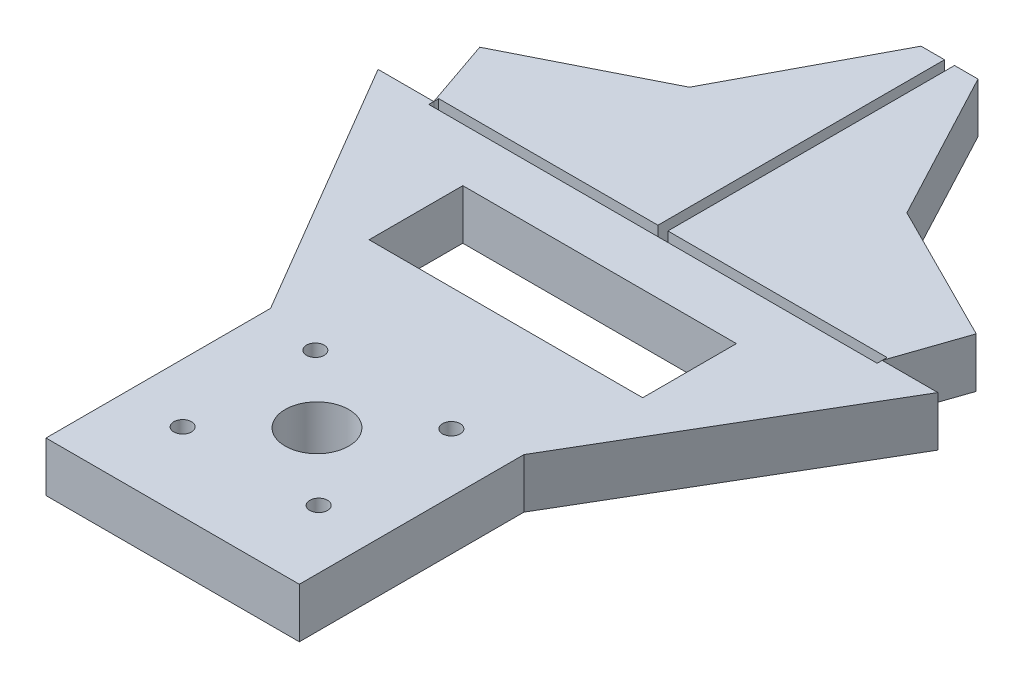
ISO-10303-21;
HEADER;
FILE_DESCRIPTION(('STEP AP214'),'2;1');
FILE_NAME('part.step','',(''),(''),'','','');
FILE_SCHEMA(('AUTOMOTIVE_DESIGN { 1 0 10303 214 1 1 1 1 }'));
ENDSEC;
DATA;
#1=APPLICATION_CONTEXT('core data for automotive mechanical design processes');
#2=APPLICATION_PROTOCOL_DEFINITION('international standard','automotive_design',2000,#1);
#3=PRODUCT_CONTEXT('',#1,'mechanical');
#4=PRODUCT('Part','Part','',(#3));
#5=PRODUCT_RELATED_PRODUCT_CATEGORY('part','',(#4));
#6=PRODUCT_DEFINITION_FORMATION('','',#4);
#7=PRODUCT_DEFINITION_CONTEXT('part definition',#1,'design');
#8=PRODUCT_DEFINITION('design','',#6,#7);
#9=PRODUCT_DEFINITION_SHAPE('','',#8);
#10=(LENGTH_UNIT() NAMED_UNIT(*) SI_UNIT(.MILLI.,.METRE.));
#11=(NAMED_UNIT(*) PLANE_ANGLE_UNIT() SI_UNIT($,.RADIAN.));
#12=(NAMED_UNIT(*) SI_UNIT($,.STERADIAN.) SOLID_ANGLE_UNIT());
#13=UNCERTAINTY_MEASURE_WITH_UNIT(LENGTH_MEASURE(1.E-05),#10,'distance_accuracy_value','');
#14=(GEOMETRIC_REPRESENTATION_CONTEXT(3) GLOBAL_UNCERTAINTY_ASSIGNED_CONTEXT((#13)) GLOBAL_UNIT_ASSIGNED_CONTEXT((#10,
#11,#12)) REPRESENTATION_CONTEXT('',''));
#15=CARTESIAN_POINT('',(0.,0.,0.));
#16=DIRECTION('',(0.,0.,1.));
#17=DIRECTION('',(1.,0.,0.));
#18=AXIS2_PLACEMENT_3D('',#15,#16,#17);
#19=CARTESIAN_POINT('',(0.,10.,0.));
#20=DIRECTION('',(0.,0.,1.));
#21=DIRECTION('',(1.,0.,0.));
#22=AXIS2_PLACEMENT_3D('',#19,#20,#21);
#23=PLANE('',#22);
#24=DIRECTION('',(-1.,0.,0.));
#25=VECTOR('',#24,1.);
#26=CARTESIAN_POINT('',(0.,0.,0.));
#27=LINE('',#26,#25);
#28=CARTESIAN_POINT('',(5.70896,0.,0.));
#29=VERTEX_POINT('',#28);
#30=CARTESIAN_POINT('',(1.,0.,0.));
#31=VERTEX_POINT('',#30);
#32=EDGE_CURVE('E98',#29,#31,#27,.T.);
#33=ORIENTED_EDGE('',*,*,#32,.T.);
#34=DIRECTION('',(0.,1.,0.));
#35=VECTOR('',#34,1.);
#36=CARTESIAN_POINT('',(1.,0.,0.));
#37=LINE('',#36,#35);
#38=CARTESIAN_POINT('',(1.,10.,0.));
#39=VERTEX_POINT('',#38);
#40=EDGE_CURVE('E86',#31,#39,#37,.T.);
#41=ORIENTED_EDGE('',*,*,#40,.T.);
#42=DIRECTION('',(-1.,0.,0.));
#43=VECTOR('',#42,1.);
#44=CARTESIAN_POINT('',(0.,10.,0.));
#45=LINE('',#44,#43);
#46=CARTESIAN_POINT('',(5.70896,10.,0.));
#47=VERTEX_POINT('',#46);
#48=EDGE_CURVE('E52',#47,#39,#45,.T.);
#49=ORIENTED_EDGE('',*,*,#48,.F.);
#50=DIRECTION('',(0.,-1.,0.));
#51=VECTOR('',#50,1.);
#52=CARTESIAN_POINT('',(5.70896,10.,0.));
#53=LINE('',#52,#51);
#54=EDGE_CURVE('E97',#47,#29,#53,.T.);
#55=ORIENTED_EDGE('',*,*,#54,.T.);
#56=EDGE_LOOP('',(#33,#41,#49,#55));
#57=FACE_BOUND('',#56,.T.);
#58=ADVANCED_FACE('F49',(#57),#23,.F.);
#59=CARTESIAN_POINT('',(0.,10.,0.));
#60=DIRECTION('',(0.,1.,0.));
#61=DIRECTION('',(0.,0.,1.));
#62=AXIS2_PLACEMENT_3D('',#59,#60,#61);
#63=PLANE('',#62);
#64=DIRECTION('',(0.,0.,-1.));
#65=VECTOR('',#64,1.);
#66=CARTESIAN_POINT('',(1.,10.,0.));
#67=LINE('',#66,#65);
#68=CARTESIAN_POINT('',(1.,10.,57.4708));
#69=VERTEX_POINT('',#68);
#70=EDGE_CURVE('E92',#69,#39,#67,.T.);
#71=ORIENTED_EDGE('',*,*,#70,.F.);
#72=DIRECTION('',(-1.,0.,0.));
#73=VECTOR('',#72,1.);
#74=CARTESIAN_POINT('',(1.,10.,57.4708));
#75=LINE('',#74,#73);
#76=CARTESIAN_POINT('',(44.9535276722083,10.,57.4708));
#77=VERTEX_POINT('',#76);
#78=EDGE_CURVE('E118',#77,#69,#75,.T.);
#79=ORIENTED_EDGE('',*,*,#78,.F.);
#80=DIRECTION('',(0.,0.,-1.));
#81=VECTOR('',#80,1.);
#82=CARTESIAN_POINT('',(44.9535276722083,10.,59.4708));
#83=LINE('',#82,#81);
#84=CARTESIAN_POINT('',(44.9535276722083,10.,58.4708));
#85=VERTEX_POINT('',#84);
#86=EDGE_CURVE('E12',#85,#77,#83,.T.);
#87=ORIENTED_EDGE('',*,*,#86,.F.);
#88=DIRECTION('',(-0.324824236659069,0.,0.945774399779807));
#89=VECTOR('',#88,1.);
#90=CARTESIAN_POINT('',(58.1732863228836,10.,19.9794933423652));
#91=LINE('',#90,#89);
#92=CARTESIAN_POINT('',(49.7781951130705,10.,44.4230583660901));
#93=VERTEX_POINT('',#92);
#94=EDGE_CURVE('E116',#93,#85,#91,.T.);
#95=ORIENTED_EDGE('',*,*,#94,.F.);
#96=DIRECTION('',(0.893364361129769,0.,0.449332970371862));
#97=VECTOR('',#96,1.);
#98=CARTESIAN_POINT('',(-7.78199451765094,10.,15.4721710156793));
#99=LINE('',#98,#97);
#100=CARTESIAN_POINT('',(21.8094583863086,10.,30.3557011960642));
#101=VERTEX_POINT('',#100);
#102=EDGE_CURVE('E115',#101,#93,#99,.T.);
#103=ORIENTED_EDGE('',*,*,#102,.F.);
#104=DIRECTION('',(0.468565731383776,0.,0.883428636264858));
#105=VECTOR('',#104,1.);
#106=CARTESIAN_POINT('',(4.45553588317703,10.,-2.36319193662813));
#107=LINE('',#106,#105);
#108=EDGE_CURVE('E132',#47,#101,#107,.T.);
#109=ORIENTED_EDGE('',*,*,#108,.F.);
#110=ORIENTED_EDGE('',*,*,#48,.T.);
#111=EDGE_LOOP('',(#71,#79,#87,#95,#103,#109,#110));
#112=FACE_BOUND('',#111,.T.);
#113=ADVANCED_FACE('F170',(#112),#63,.T.);
#114=CARTESIAN_POINT('',(0.,0.,0.));
#115=DIRECTION('',(0.,1.,0.));
#116=DIRECTION('',(0.,0.,1.));
#117=AXIS2_PLACEMENT_3D('',#114,#115,#116);
#118=PLANE('',#117);
#119=DIRECTION('',(-1.,0.,0.));
#120=VECTOR('',#119,1.);
#121=CARTESIAN_POINT('',(1.,0.,57.4708));
#122=LINE('',#121,#120);
#123=CARTESIAN_POINT('',(44.9535276722083,0.,57.4708));
#124=VERTEX_POINT('',#123);
#125=CARTESIAN_POINT('',(1.,0.,57.4708));
#126=VERTEX_POINT('',#125);
#127=EDGE_CURVE('E107',#124,#126,#122,.T.);
#128=ORIENTED_EDGE('',*,*,#127,.T.);
#129=DIRECTION('',(0.,0.,-1.));
#130=VECTOR('',#129,1.);
#131=CARTESIAN_POINT('',(1.,0.,0.));
#132=LINE('',#131,#130);
#133=EDGE_CURVE('E89',#126,#31,#132,.T.);
#134=ORIENTED_EDGE('',*,*,#133,.T.);
#135=ORIENTED_EDGE('',*,*,#32,.F.);
#136=DIRECTION('',(0.468565731383776,0.,0.883428636264858));
#137=VECTOR('',#136,1.);
#138=CARTESIAN_POINT('',(4.45553588317703,0.,-2.36319193662813));
#139=LINE('',#138,#137);
#140=CARTESIAN_POINT('',(21.8094583863086,0.,30.3557011960642));
#141=VERTEX_POINT('',#140);
#142=EDGE_CURVE('E108',#29,#141,#139,.T.);
#143=ORIENTED_EDGE('',*,*,#142,.T.);
#144=DIRECTION('',(0.893364361129769,0.,0.449332970371862));
#145=VECTOR('',#144,1.);
#146=CARTESIAN_POINT('',(-7.78199451765094,0.,15.4721710156793));
#147=LINE('',#146,#145);
#148=CARTESIAN_POINT('',(49.7781951130705,0.,44.4230583660901));
#149=VERTEX_POINT('',#148);
#150=EDGE_CURVE('E138',#141,#149,#147,.T.);
#151=ORIENTED_EDGE('',*,*,#150,.T.);
#152=DIRECTION('',(-0.324824236659069,0.,0.945774399779807));
#153=VECTOR('',#152,1.);
#154=CARTESIAN_POINT('',(58.1732863228836,0.,19.9794933423652));
#155=LINE('',#154,#153);
#156=CARTESIAN_POINT('',(44.9535276722083,0.,58.4708));
#157=VERTEX_POINT('',#156);
#158=EDGE_CURVE('E135',#149,#157,#155,.T.);
#159=ORIENTED_EDGE('',*,*,#158,.T.);
#160=DIRECTION('',(0.,0.,-1.));
#161=VECTOR('',#160,1.);
#162=CARTESIAN_POINT('',(44.9535276722083,0.,0.));
#163=LINE('',#162,#161);
#164=EDGE_CURVE('E67',#157,#124,#163,.T.);
#165=ORIENTED_EDGE('',*,*,#164,.T.);
#166=EDGE_LOOP('',(#128,#134,#135,#143,#151,#159,#165));
#167=FACE_BOUND('',#166,.T.);
#168=ADVANCED_FACE('F102',(#167),#118,.F.);
#169=CARTESIAN_POINT('',(58.1732863228836,10.,19.9794933423652));
#170=DIRECTION('',(0.945774399779807,0.,0.324824236659069));
#171=DIRECTION('',(0.324824236659069,0.,-0.945774399779807));
#172=AXIS2_PLACEMENT_3D('',#169,#170,#171);
#173=PLANE('',#172);
#174=ORIENTED_EDGE('',*,*,#158,.F.);
#175=DIRECTION('',(0.,-1.,0.));
#176=VECTOR('',#175,1.);
#177=CARTESIAN_POINT('',(49.7781951130705,10.,44.4230583660901));
#178=LINE('',#177,#176);
#179=EDGE_CURVE('E131',#93,#149,#178,.T.);
#180=ORIENTED_EDGE('',*,*,#179,.F.);
#181=ORIENTED_EDGE('',*,*,#94,.T.);
#182=DIRECTION('',(0.,-1.,0.));
#183=VECTOR('',#182,1.);
#184=CARTESIAN_POINT('',(44.9535276722083,10.,58.4708));
#185=LINE('',#184,#183);
#186=EDGE_CURVE('E113',#85,#157,#185,.T.);
#187=ORIENTED_EDGE('',*,*,#186,.T.);
#188=EDGE_LOOP('',(#174,#180,#181,#187));
#189=FACE_BOUND('',#188,.T.);
#190=ADVANCED_FACE('F167',(#189),#173,.T.);
#191=CARTESIAN_POINT('',(-7.78199451765094,10.,15.4721710156793));
#192=DIRECTION('',(0.449332970371862,0.,-0.893364361129769));
#193=DIRECTION('',(-0.893364361129769,0.,-0.449332970371862));
#194=AXIS2_PLACEMENT_3D('',#191,#192,#193);
#195=PLANE('',#194);
#196=ORIENTED_EDGE('',*,*,#150,.F.);
#197=DIRECTION('',(0.,-1.,0.));
#198=VECTOR('',#197,1.);
#199=CARTESIAN_POINT('',(21.8094583863086,10.,30.3557011960642));
#200=LINE('',#199,#198);
#201=EDGE_CURVE('E122',#101,#141,#200,.T.);
#202=ORIENTED_EDGE('',*,*,#201,.F.);
#203=ORIENTED_EDGE('',*,*,#102,.T.);
#204=ORIENTED_EDGE('',*,*,#179,.T.);
#205=EDGE_LOOP('',(#196,#202,#203,#204));
#206=FACE_BOUND('',#205,.T.);
#207=ADVANCED_FACE('F173',(#206),#195,.T.);
#208=CARTESIAN_POINT('',(4.45553588317703,10.,-2.36319193662813));
#209=DIRECTION('',(0.883428636264858,0.,-0.468565731383776));
#210=DIRECTION('',(-0.468565731383776,0.,-0.883428636264858));
#211=AXIS2_PLACEMENT_3D('',#208,#209,#210);
#212=PLANE('',#211);
#213=ORIENTED_EDGE('',*,*,#142,.F.);
#214=ORIENTED_EDGE('',*,*,#54,.F.);
#215=ORIENTED_EDGE('',*,*,#108,.T.);
#216=ORIENTED_EDGE('',*,*,#201,.T.);
#217=EDGE_LOOP('',(#213,#214,#215,#216));
#218=FACE_BOUND('',#217,.T.);
#219=ADVANCED_FACE('F175',(#218),#212,.T.);
#220=CARTESIAN_POINT('',(1.,0.,0.));
#221=DIRECTION('',(1.,0.,0.));
#222=DIRECTION('',(0.,0.,-1.));
#223=AXIS2_PLACEMENT_3D('',#220,#221,#222);
#224=PLANE('',#223);
#225=ORIENTED_EDGE('',*,*,#70,.T.);
#226=ORIENTED_EDGE('',*,*,#40,.F.);
#227=ORIENTED_EDGE('',*,*,#133,.F.);
#228=DIRECTION('',(0.,1.,0.));
#229=VECTOR('',#228,1.);
#230=CARTESIAN_POINT('',(1.,0.,57.4708));
#231=LINE('',#230,#229);
#232=EDGE_CURVE('E121',#126,#69,#231,.T.);
#233=ORIENTED_EDGE('',*,*,#232,.T.);
#234=EDGE_LOOP('',(#225,#226,#227,#233));
#235=FACE_BOUND('',#234,.T.);
#236=ADVANCED_FACE('F88',(#235),#224,.F.);
#237=CARTESIAN_POINT('',(1.,0.,57.4708));
#238=DIRECTION('',(0.,0.,-1.));
#239=DIRECTION('',(-1.,0.,0.));
#240=AXIS2_PLACEMENT_3D('',#237,#238,#239);
#241=PLANE('',#240);
#242=ORIENTED_EDGE('',*,*,#78,.T.);
#243=ORIENTED_EDGE('',*,*,#232,.F.);
#244=ORIENTED_EDGE('',*,*,#127,.F.);
#245=DIRECTION('',(0.,1.,0.));
#246=VECTOR('',#245,1.);
#247=CARTESIAN_POINT('',(44.9535276722083,0.,57.4708));
#248=LINE('',#247,#246);
#249=EDGE_CURVE('E58',#124,#77,#248,.T.);
#250=ORIENTED_EDGE('',*,*,#249,.T.);
#251=EDGE_LOOP('',(#242,#243,#244,#250));
#252=FACE_BOUND('',#251,.T.);
#253=ADVANCED_FACE('F196',(#252),#241,.F.);
#254=CARTESIAN_POINT('',(44.9535276722083,0.,59.4708));
#255=DIRECTION('',(1.,0.,0.));
#256=DIRECTION('',(0.,0.,-1.));
#257=AXIS2_PLACEMENT_3D('',#254,#255,#256);
#258=PLANE('',#257);
#259=ORIENTED_EDGE('',*,*,#186,.F.);
#260=ORIENTED_EDGE('',*,*,#86,.T.);
#261=ORIENTED_EDGE('',*,*,#249,.F.);
#262=ORIENTED_EDGE('',*,*,#164,.F.);
#263=EDGE_LOOP('',(#259,#260,#261,#262));
#264=FACE_BOUND('',#263,.T.);
#265=ADVANCED_FACE('F193',(#264),#258,.F.);
#266=CLOSED_SHELL('',(#58,#113,#168,#190,#207,#219,#236,#253,#265));
#267=MANIFOLD_SOLID_BREP('B2',#266);
#268=CARTESIAN_POINT('',(-4.45553588317703,10.,-2.36319193662813));
#269=DIRECTION('',(0.883428636264858,0.,0.468565731383776));
#270=DIRECTION('',(0.468565731383776,0.,-0.883428636264858));
#271=AXIS2_PLACEMENT_3D('',#268,#269,#270);
#272=PLANE('',#271);
#273=DIRECTION('',(-0.468565731383776,0.,0.883428636264858));
#274=VECTOR('',#273,1.);
#275=CARTESIAN_POINT('',(-4.45553588317703,0.,-2.36319193662813));
#276=LINE('',#275,#274);
#277=CARTESIAN_POINT('',(-5.70896,0.,0.));
#278=VERTEX_POINT('',#277);
#279=CARTESIAN_POINT('',(-21.8094583863086,0.,30.3557011960642));
#280=VERTEX_POINT('',#279);
#281=EDGE_CURVE('E382',#278,#280,#276,.T.);
#282=ORIENTED_EDGE('',*,*,#281,.T.);
#283=DIRECTION('',(0.,-1.,0.));
#284=VECTOR('',#283,1.);
#285=CARTESIAN_POINT('',(-21.8094583863086,10.,30.3557011960642));
#286=LINE('',#285,#284);
#287=CARTESIAN_POINT('',(-21.8094583863086,10.,30.3557011960642));
#288=VERTEX_POINT('',#287);
#289=EDGE_CURVE('E376',#288,#280,#286,.T.);
#290=ORIENTED_EDGE('',*,*,#289,.F.);
#291=DIRECTION('',(-0.468565731383776,0.,0.883428636264858));
#292=VECTOR('',#291,1.);
#293=CARTESIAN_POINT('',(-4.45553588317703,10.,-2.36319193662813));
#294=LINE('',#293,#292);
#295=CARTESIAN_POINT('',(-5.70896,10.,0.));
#296=VERTEX_POINT('',#295);
#297=EDGE_CURVE('E385',#296,#288,#294,.T.);
#298=ORIENTED_EDGE('',*,*,#297,.F.);
#299=DIRECTION('',(0.,-1.,0.));
#300=VECTOR('',#299,1.);
#301=CARTESIAN_POINT('',(-5.70896,10.,0.));
#302=LINE('',#301,#300);
#303=EDGE_CURVE('E381',#296,#278,#302,.T.);
#304=ORIENTED_EDGE('',*,*,#303,.T.);
#305=EDGE_LOOP('',(#282,#290,#298,#304));
#306=FACE_BOUND('',#305,.T.);
#307=ADVANCED_FACE('F277',(#306),#272,.F.);
#308=CARTESIAN_POINT('',(7.78199451765094,10.,15.4721710156793));
#309=DIRECTION('',(0.449332970371862,0.,0.893364361129769));
#310=DIRECTION('',(0.893364361129769,0.,-0.449332970371862));
#311=AXIS2_PLACEMENT_3D('',#308,#309,#310);
#312=PLANE('',#311);
#313=DIRECTION('',(-0.893364361129769,0.,0.449332970371862));
#314=VECTOR('',#313,1.);
#315=CARTESIAN_POINT('',(7.78199451765094,0.,15.4721710156793));
#316=LINE('',#315,#314);
#317=CARTESIAN_POINT('',(-49.7781951130705,0.,44.4230583660901));
#318=VERTEX_POINT('',#317);
#319=EDGE_CURVE('E379',#280,#318,#316,.T.);
#320=ORIENTED_EDGE('',*,*,#319,.T.);
#321=DIRECTION('',(0.,-1.,0.));
#322=VECTOR('',#321,1.);
#323=CARTESIAN_POINT('',(-49.7781951130705,10.,44.4230583660901));
#324=LINE('',#323,#322);
#325=CARTESIAN_POINT('',(-49.7781951130705,10.,44.4230583660901));
#326=VERTEX_POINT('',#325);
#327=EDGE_CURVE('E362',#326,#318,#324,.T.);
#328=ORIENTED_EDGE('',*,*,#327,.F.);
#329=DIRECTION('',(-0.893364361129769,0.,0.449332970371862));
#330=VECTOR('',#329,1.);
#331=CARTESIAN_POINT('',(7.78199451765094,10.,15.4721710156793));
#332=LINE('',#331,#330);
#333=EDGE_CURVE('E354',#288,#326,#332,.T.);
#334=ORIENTED_EDGE('',*,*,#333,.F.);
#335=ORIENTED_EDGE('',*,*,#289,.T.);
#336=EDGE_LOOP('',(#320,#328,#334,#335));
#337=FACE_BOUND('',#336,.T.);
#338=ADVANCED_FACE('F401',(#337),#312,.F.);
#339=CARTESIAN_POINT('',(0.,10.,0.));
#340=DIRECTION('',(0.,1.,0.));
#341=DIRECTION('',(0.,0.,1.));
#342=AXIS2_PLACEMENT_3D('',#339,#340,#341);
#343=PLANE('',#342);
#344=DIRECTION('',(0.,0.,1.));
#345=VECTOR('',#344,1.);
#346=CARTESIAN_POINT('',(-44.9535276722083,10.,59.4708));
#347=LINE('',#346,#345);
#348=CARTESIAN_POINT('',(-44.9535276722083,10.,57.4708));
#349=VERTEX_POINT('',#348);
#350=CARTESIAN_POINT('',(-44.9535276722083,10.,58.4708));
#351=VERTEX_POINT('',#350);
#352=EDGE_CURVE('E287',#349,#351,#347,.T.);
#353=ORIENTED_EDGE('',*,*,#352,.F.);
#354=DIRECTION('',(-1.,0.,0.));
#355=VECTOR('',#354,1.);
#356=CARTESIAN_POINT('',(-44.9535276722083,10.,57.4708));
#357=LINE('',#356,#355);
#358=CARTESIAN_POINT('',(-1.,10.,57.4708));
#359=VERTEX_POINT('',#358);
#360=EDGE_CURVE('E337',#359,#349,#357,.T.);
#361=ORIENTED_EDGE('',*,*,#360,.F.);
#362=DIRECTION('',(0.,0.,1.));
#363=VECTOR('',#362,1.);
#364=CARTESIAN_POINT('',(-1.,10.,0.));
#365=LINE('',#364,#363);
#366=CARTESIAN_POINT('',(-1.,10.,0.));
#367=VERTEX_POINT('',#366);
#368=EDGE_CURVE('E361',#367,#359,#365,.T.);
#369=ORIENTED_EDGE('',*,*,#368,.F.);
#370=DIRECTION('',(-1.,0.,0.));
#371=VECTOR('',#370,1.);
#372=CARTESIAN_POINT('',(0.,10.,0.));
#373=LINE('',#372,#371);
#374=EDGE_CURVE('E281',#367,#296,#373,.T.);
#375=ORIENTED_EDGE('',*,*,#374,.T.);
#376=ORIENTED_EDGE('',*,*,#297,.T.);
#377=ORIENTED_EDGE('',*,*,#333,.T.);
#378=DIRECTION('',(0.324824236659069,0.,0.945774399779807));
#379=VECTOR('',#378,1.);
#380=CARTESIAN_POINT('',(-58.1732863228836,10.,19.9794933423652));
#381=LINE('',#380,#379);
#382=EDGE_CURVE('E351',#326,#351,#381,.T.);
#383=ORIENTED_EDGE('',*,*,#382,.T.);
#384=EDGE_LOOP('',(#353,#361,#369,#375,#376,#377,#383));
#385=FACE_BOUND('',#384,.T.);
#386=ADVANCED_FACE('F394',(#385),#343,.T.);
#387=CARTESIAN_POINT('',(0.,0.,0.));
#388=DIRECTION('',(0.,1.,0.));
#389=DIRECTION('',(0.,0.,1.));
#390=AXIS2_PLACEMENT_3D('',#387,#388,#389);
#391=PLANE('',#390);
#392=DIRECTION('',(-1.,0.,0.));
#393=VECTOR('',#392,1.);
#394=CARTESIAN_POINT('',(-44.9535276722083,0.,57.4708));
#395=LINE('',#394,#393);
#396=CARTESIAN_POINT('',(-1.,0.,57.4708));
#397=VERTEX_POINT('',#396);
#398=CARTESIAN_POINT('',(-44.9535276722083,0.,57.4708));
#399=VERTEX_POINT('',#398);
#400=EDGE_CURVE('E334',#397,#399,#395,.T.);
#401=ORIENTED_EDGE('',*,*,#400,.T.);
#402=DIRECTION('',(0.,0.,1.));
#403=VECTOR('',#402,1.);
#404=CARTESIAN_POINT('',(-44.9535276722083,0.,59.4708));
#405=LINE('',#404,#403);
#406=CARTESIAN_POINT('',(-44.9535276722083,0.,58.4708));
#407=VERTEX_POINT('',#406);
#408=EDGE_CURVE('E342',#399,#407,#405,.T.);
#409=ORIENTED_EDGE('',*,*,#408,.T.);
#410=DIRECTION('',(0.324824236659069,0.,0.945774399779807));
#411=VECTOR('',#410,1.);
#412=CARTESIAN_POINT('',(-58.1732863228836,0.,19.9794933423652));
#413=LINE('',#412,#411);
#414=EDGE_CURVE('E358',#318,#407,#413,.T.);
#415=ORIENTED_EDGE('',*,*,#414,.F.);
#416=ORIENTED_EDGE('',*,*,#319,.F.);
#417=ORIENTED_EDGE('',*,*,#281,.F.);
#418=DIRECTION('',(-1.,0.,0.));
#419=VECTOR('',#418,1.);
#420=CARTESIAN_POINT('',(0.,0.,0.));
#421=LINE('',#420,#419);
#422=CARTESIAN_POINT('',(-1.,0.,0.));
#423=VERTEX_POINT('',#422);
#424=EDGE_CURVE('E360',#423,#278,#421,.T.);
#425=ORIENTED_EDGE('',*,*,#424,.F.);
#426=DIRECTION('',(0.,0.,1.));
#427=VECTOR('',#426,1.);
#428=CARTESIAN_POINT('',(-1.,0.,0.));
#429=LINE('',#428,#427);
#430=EDGE_CURVE('E345',#423,#397,#429,.T.);
#431=ORIENTED_EDGE('',*,*,#430,.T.);
#432=EDGE_LOOP('',(#401,#409,#415,#416,#417,#425,#431));
#433=FACE_BOUND('',#432,.T.);
#434=ADVANCED_FACE('F348',(#433),#391,.F.);
#435=CARTESIAN_POINT('',(-58.1732863228836,10.,19.9794933423652));
#436=DIRECTION('',(0.945774399779807,0.,-0.324824236659069));
#437=DIRECTION('',(-0.324824236659069,0.,-0.945774399779807));
#438=AXIS2_PLACEMENT_3D('',#435,#436,#437);
#439=PLANE('',#438);
#440=ORIENTED_EDGE('',*,*,#414,.T.);
#441=DIRECTION('',(0.,-1.,0.));
#442=VECTOR('',#441,1.);
#443=CARTESIAN_POINT('',(-44.9535276722083,10.,58.4708));
#444=LINE('',#443,#442);
#445=EDGE_CURVE('E47',#351,#407,#444,.T.);
#446=ORIENTED_EDGE('',*,*,#445,.F.);
#447=ORIENTED_EDGE('',*,*,#382,.F.);
#448=ORIENTED_EDGE('',*,*,#327,.T.);
#449=EDGE_LOOP('',(#440,#446,#447,#448));
#450=FACE_BOUND('',#449,.T.);
#451=ADVANCED_FACE('F396',(#450),#439,.F.);
#452=CARTESIAN_POINT('',(0.,10.,0.));
#453=DIRECTION('',(0.,0.,1.));
#454=DIRECTION('',(1.,0.,0.));
#455=AXIS2_PLACEMENT_3D('',#452,#453,#454);
#456=PLANE('',#455);
#457=ORIENTED_EDGE('',*,*,#374,.F.);
#458=DIRECTION('',(0.,1.,0.));
#459=VECTOR('',#458,1.);
#460=CARTESIAN_POINT('',(-1.,0.,0.));
#461=LINE('',#460,#459);
#462=EDGE_CURVE('E368',#423,#367,#461,.T.);
#463=ORIENTED_EDGE('',*,*,#462,.F.);
#464=ORIENTED_EDGE('',*,*,#424,.T.);
#465=ORIENTED_EDGE('',*,*,#303,.F.);
#466=EDGE_LOOP('',(#457,#463,#464,#465));
#467=FACE_BOUND('',#466,.T.);
#468=ADVANCED_FACE('F405',(#467),#456,.F.);
#469=CARTESIAN_POINT('',(-1.,0.,0.));
#470=DIRECTION('',(-1.,0.,0.));
#471=DIRECTION('',(0.,0.,1.));
#472=AXIS2_PLACEMENT_3D('',#469,#470,#471);
#473=PLANE('',#472);
#474=ORIENTED_EDGE('',*,*,#368,.T.);
#475=DIRECTION('',(0.,1.,0.));
#476=VECTOR('',#475,1.);
#477=CARTESIAN_POINT('',(-1.,0.,57.4708));
#478=LINE('',#477,#476);
#479=EDGE_CURVE('E339',#397,#359,#478,.T.);
#480=ORIENTED_EDGE('',*,*,#479,.F.);
#481=ORIENTED_EDGE('',*,*,#430,.F.);
#482=ORIENTED_EDGE('',*,*,#462,.T.);
#483=EDGE_LOOP('',(#474,#480,#481,#482));
#484=FACE_BOUND('',#483,.T.);
#485=ADVANCED_FACE('F391',(#484),#473,.F.);
#486=CARTESIAN_POINT('',(-44.9535276722083,0.,57.4708));
#487=DIRECTION('',(0.,0.,-1.));
#488=DIRECTION('',(-1.,0.,0.));
#489=AXIS2_PLACEMENT_3D('',#486,#487,#488);
#490=PLANE('',#489);
#491=ORIENTED_EDGE('',*,*,#360,.T.);
#492=DIRECTION('',(0.,1.,0.));
#493=VECTOR('',#492,1.);
#494=CARTESIAN_POINT('',(-44.9535276722083,0.,57.4708));
#495=LINE('',#494,#493);
#496=EDGE_CURVE('E331',#399,#349,#495,.T.);
#497=ORIENTED_EDGE('',*,*,#496,.F.);
#498=ORIENTED_EDGE('',*,*,#400,.F.);
#499=ORIENTED_EDGE('',*,*,#479,.T.);
#500=EDGE_LOOP('',(#491,#497,#498,#499));
#501=FACE_BOUND('',#500,.T.);
#502=ADVANCED_FACE('F332',(#501),#490,.F.);
#503=CARTESIAN_POINT('',(-44.9535276722083,0.,59.4708));
#504=DIRECTION('',(-1.,0.,0.));
#505=DIRECTION('',(0.,0.,1.));
#506=AXIS2_PLACEMENT_3D('',#503,#504,#505);
#507=PLANE('',#506);
#508=ORIENTED_EDGE('',*,*,#408,.F.);
#509=ORIENTED_EDGE('',*,*,#496,.T.);
#510=ORIENTED_EDGE('',*,*,#352,.T.);
#511=ORIENTED_EDGE('',*,*,#445,.T.);
#512=EDGE_LOOP('',(#508,#509,#510,#511));
#513=FACE_BOUND('',#512,.T.);
#514=ADVANCED_FACE('F279',(#513),#507,.F.);
#515=CLOSED_SHELL('',(#307,#338,#386,#434,#451,#468,#485,#502,#514));
#516=MANIFOLD_SOLID_BREP('B6',#515);
#517=CARTESIAN_POINT('',(-67.2555072535485,10.,39.530089231274));
#518=DIRECTION('',(-0.862113275919464,0.,0.506715600197399));
#519=DIRECTION('',(0.506715600197399,0.,0.862113275919464));
#520=AXIS2_PLACEMENT_3D('',#517,#518,#519);
#521=PLANE('',#520);
#522=DIRECTION('',(-0.506715600197399,0.,-0.862113275919464));
#523=VECTOR('',#522,1.);
#524=CARTESIAN_POINT('',(-67.2555072535485,0.,39.530089231274));
#525=LINE('',#524,#523);
#526=CARTESIAN_POINT('',(-25.4,0.,110.742004671751));
#527=VERTEX_POINT('',#526);
#528=CARTESIAN_POINT('',(-56.1229172640203,0.,58.4708));
#529=VERTEX_POINT('',#528);
#530=EDGE_CURVE('E761',#527,#529,#525,.T.);
#531=ORIENTED_EDGE('',*,*,#530,.F.);
#532=DIRECTION('',(0.,-1.,0.));
#533=VECTOR('',#532,1.);
#534=CARTESIAN_POINT('',(-25.4,10.,110.742004671751));
#535=LINE('',#534,#533);
#536=CARTESIAN_POINT('',(-25.4,10.,110.742004671751));
#537=VERTEX_POINT('',#536);
#538=EDGE_CURVE('E770',#537,#527,#535,.T.);
#539=ORIENTED_EDGE('',*,*,#538,.F.);
#540=DIRECTION('',(-0.506715600197399,0.,-0.862113275919464));
#541=VECTOR('',#540,1.);
#542=CARTESIAN_POINT('',(-67.2555072535485,10.,39.530089231274));
#543=LINE('',#542,#541);
#544=CARTESIAN_POINT('',(-56.1229172640203,10.,58.4708));
#545=VERTEX_POINT('',#544);
#546=EDGE_CURVE('E733',#537,#545,#543,.T.);
#547=ORIENTED_EDGE('',*,*,#546,.T.);
#548=DIRECTION('',(0.,-1.,0.));
#549=VECTOR('',#548,1.);
#550=CARTESIAN_POINT('',(-56.1229172640203,10.,58.4708));
#551=LINE('',#550,#549);
#552=EDGE_CURVE('E773',#545,#529,#551,.T.);
#553=ORIENTED_EDGE('',*,*,#552,.T.);
#554=EDGE_LOOP('',(#531,#539,#547,#553));
#555=FACE_BOUND('',#554,.T.);
#556=ADVANCED_FACE('F496',(#555),#521,.T.);
#557=CARTESIAN_POINT('',(-25.4,10.,0.));
#558=DIRECTION('',(-1.,0.,0.));
#559=DIRECTION('',(0.,0.,1.));
#560=AXIS2_PLACEMENT_3D('',#557,#558,#559);
#561=PLANE('',#560);
#562=DIRECTION('',(0.,0.,-1.));
#563=VECTOR('',#562,1.);
#564=CARTESIAN_POINT('',(-25.4,0.,0.));
#565=LINE('',#564,#563);
#566=CARTESIAN_POINT('',(-25.4,0.,155.776769040483));
#567=VERTEX_POINT('',#566);
#568=EDGE_CURVE('E717',#567,#527,#565,.T.);
#569=ORIENTED_EDGE('',*,*,#568,.F.);
#570=DIRECTION('',(0.,-1.,0.));
#571=VECTOR('',#570,1.);
#572=CARTESIAN_POINT('',(-25.4,10.,155.776769040483));
#573=LINE('',#572,#571);
#574=CARTESIAN_POINT('',(-25.4,10.,155.776769040483));
#575=VERTEX_POINT('',#574);
#576=EDGE_CURVE('E741',#575,#567,#573,.T.);
#577=ORIENTED_EDGE('',*,*,#576,.F.);
#578=DIRECTION('',(0.,0.,-1.));
#579=VECTOR('',#578,1.);
#580=CARTESIAN_POINT('',(-25.4,10.,0.));
#581=LINE('',#580,#579);
#582=EDGE_CURVE('E737',#575,#537,#581,.T.);
#583=ORIENTED_EDGE('',*,*,#582,.T.);
#584=ORIENTED_EDGE('',*,*,#538,.T.);
#585=EDGE_LOOP('',(#569,#577,#583,#584));
#586=FACE_BOUND('',#585,.T.);
#587=ADVANCED_FACE('F824',(#586),#561,.T.);
#588=CARTESIAN_POINT('',(0.,10.,155.776769040483));
#589=DIRECTION('',(0.,0.,1.));
#590=DIRECTION('',(1.,0.,0.));
#591=AXIS2_PLACEMENT_3D('',#588,#589,#590);
#592=PLANE('',#591);
#593=DIRECTION('',(-1.,0.,0.));
#594=VECTOR('',#593,1.);
#595=CARTESIAN_POINT('',(0.,0.,155.776769040483));
#596=LINE('',#595,#594);
#597=CARTESIAN_POINT('',(25.4,0.,155.776769040483));
#598=VERTEX_POINT('',#597);
#599=EDGE_CURVE('E708',#598,#567,#596,.T.);
#600=ORIENTED_EDGE('',*,*,#599,.F.);
#601=DIRECTION('',(0.,-1.,0.));
#602=VECTOR('',#601,1.);
#603=CARTESIAN_POINT('',(25.4,10.,155.776769040483));
#604=LINE('',#603,#602);
#605=CARTESIAN_POINT('',(25.4,10.,155.776769040483));
#606=VERTEX_POINT('',#605);
#607=EDGE_CURVE('E785',#606,#598,#604,.T.);
#608=ORIENTED_EDGE('',*,*,#607,.F.);
#609=DIRECTION('',(-1.,0.,0.));
#610=VECTOR('',#609,1.);
#611=CARTESIAN_POINT('',(0.,10.,155.776769040483));
#612=LINE('',#611,#610);
#613=EDGE_CURVE('E712',#606,#575,#612,.T.);
#614=ORIENTED_EDGE('',*,*,#613,.T.);
#615=ORIENTED_EDGE('',*,*,#576,.T.);
#616=EDGE_LOOP('',(#600,#608,#614,#615));
#617=FACE_BOUND('',#616,.T.);
#618=ADVANCED_FACE('F498',(#617),#592,.T.);
#619=CARTESIAN_POINT('',(25.4,10.,0.));
#620=DIRECTION('',(1.,0.,0.));
#621=DIRECTION('',(0.,0.,-1.));
#622=AXIS2_PLACEMENT_3D('',#619,#620,#621);
#623=PLANE('',#622);
#624=DIRECTION('',(0.,0.,1.));
#625=VECTOR('',#624,1.);
#626=CARTESIAN_POINT('',(25.4,0.,0.));
#627=LINE('',#626,#625);
#628=CARTESIAN_POINT('',(25.4,0.,110.742004671751));
#629=VERTEX_POINT('',#628);
#630=EDGE_CURVE('E745',#629,#598,#627,.T.);
#631=ORIENTED_EDGE('',*,*,#630,.F.);
#632=DIRECTION('',(0.,-1.,0.));
#633=VECTOR('',#632,1.);
#634=CARTESIAN_POINT('',(25.4,10.,110.742004671751));
#635=LINE('',#634,#633);
#636=CARTESIAN_POINT('',(25.4,10.,110.742004671751));
#637=VERTEX_POINT('',#636);
#638=EDGE_CURVE('E783',#637,#629,#635,.T.);
#639=ORIENTED_EDGE('',*,*,#638,.F.);
#640=DIRECTION('',(0.,0.,1.));
#641=VECTOR('',#640,1.);
#642=CARTESIAN_POINT('',(25.4,10.,0.));
#643=LINE('',#642,#641);
#644=EDGE_CURVE('E716',#637,#606,#643,.T.);
#645=ORIENTED_EDGE('',*,*,#644,.T.);
#646=ORIENTED_EDGE('',*,*,#607,.T.);
#647=EDGE_LOOP('',(#631,#639,#645,#646));
#648=FACE_BOUND('',#647,.T.);
#649=ADVANCED_FACE('F820',(#648),#623,.T.);
#650=CARTESIAN_POINT('',(67.2555072535485,10.,39.530089231274));
#651=DIRECTION('',(0.862113275919464,0.,0.506715600197399));
#652=DIRECTION('',(0.506715600197399,0.,-0.862113275919464));
#653=AXIS2_PLACEMENT_3D('',#650,#651,#652);
#654=PLANE('',#653);
#655=DIRECTION('',(-0.506715600197399,0.,0.862113275919464));
#656=VECTOR('',#655,1.);
#657=CARTESIAN_POINT('',(67.2555072535485,0.,39.530089231274));
#658=LINE('',#657,#656);
#659=CARTESIAN_POINT('',(56.1229172640203,0.,58.4708));
#660=VERTEX_POINT('',#659);
#661=EDGE_CURVE('E749',#660,#629,#658,.T.);
#662=ORIENTED_EDGE('',*,*,#661,.F.);
#663=DIRECTION('',(0.,-1.,0.));
#664=VECTOR('',#663,1.);
#665=CARTESIAN_POINT('',(56.1229172640203,10.,58.4708));
#666=LINE('',#665,#664);
#667=CARTESIAN_POINT('',(56.1229172640203,10.,58.4708));
#668=VERTEX_POINT('',#667);
#669=EDGE_CURVE('E779',#668,#660,#666,.T.);
#670=ORIENTED_EDGE('',*,*,#669,.F.);
#671=DIRECTION('',(-0.506715600197399,0.,0.862113275919464));
#672=VECTOR('',#671,1.);
#673=CARTESIAN_POINT('',(67.2555072535485,10.,39.530089231274));
#674=LINE('',#673,#672);
#675=EDGE_CURVE('E721',#668,#637,#674,.T.);
#676=ORIENTED_EDGE('',*,*,#675,.T.);
#677=ORIENTED_EDGE('',*,*,#638,.T.);
#678=EDGE_LOOP('',(#662,#670,#676,#677));
#679=FACE_BOUND('',#678,.T.);
#680=ADVANCED_FACE('F816',(#679),#654,.T.);
#681=CARTESIAN_POINT('',(0.,10.,0.));
#682=DIRECTION('',(0.,1.,0.));
#683=DIRECTION('',(0.,0.,1.));
#684=AXIS2_PLACEMENT_3D('',#681,#682,#683);
#685=PLANE('',#684);
#686=DIRECTION('',(0.,0.,1.));
#687=VECTOR('',#686,1.);
#688=CARTESIAN_POINT('',(-27.432,10.,70.1653223669218));
#689=LINE('',#688,#687);
#690=CARTESIAN_POINT('',(-27.432,10.,70.1653223669218));
#691=VERTEX_POINT('',#690);
#692=CARTESIAN_POINT('',(-27.432,10.,88.9613223669218));
#693=VERTEX_POINT('',#692);
#694=EDGE_CURVE('E513',#691,#693,#689,.T.);
#695=ORIENTED_EDGE('',*,*,#694,.F.);
#696=DIRECTION('',(-1.,0.,0.));
#697=VECTOR('',#696,1.);
#698=CARTESIAN_POINT('',(27.432,10.,70.1653223669218));
#699=LINE('',#698,#697);
#700=CARTESIAN_POINT('',(27.432,10.,70.1653223669218));
#701=VERTEX_POINT('',#700);
#702=EDGE_CURVE('E619',#701,#691,#699,.T.);
#703=ORIENTED_EDGE('',*,*,#702,.F.);
#704=DIRECTION('',(0.,0.,-1.));
#705=VECTOR('',#704,1.);
#706=CARTESIAN_POINT('',(27.432,10.,70.1653223669218));
#707=LINE('',#706,#705);
#708=CARTESIAN_POINT('',(27.432,10.,88.9613223669218));
#709=VERTEX_POINT('',#708);
#710=EDGE_CURVE('E623',#709,#701,#707,.T.);
#711=ORIENTED_EDGE('',*,*,#710,.F.);
#712=DIRECTION('',(1.,0.,0.));
#713=VECTOR('',#712,1.);
#714=CARTESIAN_POINT('',(27.432,10.,88.9613223669218));
#715=LINE('',#714,#713);
#716=EDGE_CURVE('E632',#693,#709,#715,.T.);
#717=ORIENTED_EDGE('',*,*,#716,.F.);
#718=EDGE_LOOP('',(#695,#703,#711,#717));
#719=FACE_BOUND('',#718,.T.);
#720=CARTESIAN_POINT('',(0.,10.,126.836776176731));
#721=DIRECTION('',(0.,1.,0.));
#722=DIRECTION('',(0.,0.,1.));
#723=AXIS2_PLACEMENT_3D('',#720,#721,#722);
#724=CIRCLE('',#723,6.3754);
#725=CARTESIAN_POINT('',(0.,10.,133.212176176731));
#726=VERTEX_POINT('',#725);
#727=EDGE_CURVE('E641',#726,#726,#724,.T.);
#728=ORIENTED_EDGE('',*,*,#727,.F.);
#729=EDGE_LOOP('',(#728));
#730=FACE_BOUND('',#729,.T.);
#731=CARTESIAN_POINT('',(-13.6383179733003,10.,113.536445998154));
#732=DIRECTION('',(0.,1.,0.));
#733=DIRECTION('',(0.,0.,1.));
#734=AXIS2_PLACEMENT_3D('',#731,#732,#733);
#735=CIRCLE('',#734,1.78);
#736=CARTESIAN_POINT('',(-13.6383179733003,10.,115.316445998154));
#737=VERTEX_POINT('',#736);
#738=EDGE_CURVE('E668',#737,#737,#735,.T.);
#739=ORIENTED_EDGE('',*,*,#738,.F.);
#740=EDGE_LOOP('',(#739));
#741=FACE_BOUND('',#740,.T.);
#742=CARTESIAN_POINT('',(13.6383179733003,10.,113.536445998154));
#743=DIRECTION('',(0.,1.,0.));
#744=DIRECTION('',(0.,0.,1.));
#745=AXIS2_PLACEMENT_3D('',#742,#743,#744);
#746=CIRCLE('',#745,1.78);
#747=CARTESIAN_POINT('',(13.6383179733003,10.,115.316445998154));
#748=VERTEX_POINT('',#747);
#749=EDGE_CURVE('E660',#748,#748,#746,.T.);
#750=ORIENTED_EDGE('',*,*,#749,.F.);
#751=EDGE_LOOP('',(#750));
#752=FACE_BOUND('',#751,.T.);
#753=CARTESIAN_POINT('',(13.6383179733003,10.,140.137106355307));
#754=DIRECTION('',(0.,1.,0.));
#755=DIRECTION('',(0.,0.,1.));
#756=AXIS2_PLACEMENT_3D('',#753,#754,#755);
#757=CIRCLE('',#756,1.78);
#758=CARTESIAN_POINT('',(13.6383179733003,10.,141.917106355307));
#759=VERTEX_POINT('',#758);
#760=EDGE_CURVE('E652',#759,#759,#757,.T.);
#761=ORIENTED_EDGE('',*,*,#760,.F.);
#762=EDGE_LOOP('',(#761));
#763=FACE_BOUND('',#762,.T.);
#764=CARTESIAN_POINT('',(-13.6383179733003,10.,140.137106355307));
#765=DIRECTION('',(0.,1.,0.));
#766=DIRECTION('',(0.,0.,1.));
#767=AXIS2_PLACEMENT_3D('',#764,#765,#766);
#768=CIRCLE('',#767,1.78);
#769=CARTESIAN_POINT('',(-13.6383179733003,10.,141.917106355307));
#770=VERTEX_POINT('',#769);
#771=EDGE_CURVE('E651',#770,#770,#768,.T.);
#772=ORIENTED_EDGE('',*,*,#771,.F.);
#773=EDGE_LOOP('',(#772));
#774=FACE_BOUND('',#773,.T.);
#775=DIRECTION('',(0.,0.,-1.));
#776=VECTOR('',#775,1.);
#777=CARTESIAN_POINT('',(44.9535276722083,10.,59.4708));
#778=LINE('',#777,#776);
#779=CARTESIAN_POINT('',(44.9535276722083,10.,59.4708));
#780=VERTEX_POINT('',#779);
#781=CARTESIAN_POINT('',(44.9535276722083,10.,58.4708));
#782=VERTEX_POINT('',#781);
#783=EDGE_CURVE('E692',#780,#782,#778,.T.);
#784=ORIENTED_EDGE('',*,*,#783,.F.);
#785=DIRECTION('',(1.,0.,0.));
#786=VECTOR('',#785,1.);
#787=CARTESIAN_POINT('',(-44.9535276722083,10.,59.4708));
#788=LINE('',#787,#786);
#789=CARTESIAN_POINT('',(-44.9535276722083,10.,59.4708));
#790=VERTEX_POINT('',#789);
#791=EDGE_CURVE('E699',#790,#780,#788,.T.);
#792=ORIENTED_EDGE('',*,*,#791,.F.);
#793=DIRECTION('',(0.,0.,1.));
#794=VECTOR('',#793,1.);
#795=CARTESIAN_POINT('',(-44.9535276722083,10.,59.4708));
#796=LINE('',#795,#794);
#797=CARTESIAN_POINT('',(-44.9535276722083,10.,58.4708));
#798=VERTEX_POINT('',#797);
#799=EDGE_CURVE('E683',#798,#790,#796,.T.);
#800=ORIENTED_EDGE('',*,*,#799,.F.);
#801=DIRECTION('',(1.,0.,0.));
#802=VECTOR('',#801,1.);
#803=CARTESIAN_POINT('',(0.,10.,58.4708));
#804=LINE('',#803,#802);
#805=EDGE_CURVE('E729',#545,#798,#804,.T.);
#806=ORIENTED_EDGE('',*,*,#805,.F.);
#807=ORIENTED_EDGE('',*,*,#546,.F.);
#808=ORIENTED_EDGE('',*,*,#582,.F.);
#809=ORIENTED_EDGE('',*,*,#613,.F.);
#810=ORIENTED_EDGE('',*,*,#644,.F.);
#811=ORIENTED_EDGE('',*,*,#675,.F.);
#812=DIRECTION('',(-1.,0.,0.));
#813=VECTOR('',#812,1.);
#814=CARTESIAN_POINT('',(0.,10.,58.4708));
#815=LINE('',#814,#813);
#816=EDGE_CURVE('E725',#668,#782,#815,.T.);
#817=ORIENTED_EDGE('',*,*,#816,.T.);
#818=EDGE_LOOP('',(#784,#792,#800,#806,#807,#808,#809,#810,#811,#817));
#819=FACE_BOUND('',#818,.T.);
#820=ADVANCED_FACE('F805',(#719,#730,#741,#752,#763,#774,#819),#685,.T.);
#821=CARTESIAN_POINT('',(0.,0.,0.));
#822=DIRECTION('',(0.,1.,0.));
#823=DIRECTION('',(0.,0.,1.));
#824=AXIS2_PLACEMENT_3D('',#821,#822,#823);
#825=PLANE('',#824);
#826=DIRECTION('',(-1.,0.,0.));
#827=VECTOR('',#826,1.);
#828=CARTESIAN_POINT('',(27.432,0.,70.1653223669218));
#829=LINE('',#828,#827);
#830=CARTESIAN_POINT('',(27.432,0.,70.1653223669218));
#831=VERTEX_POINT('',#830);
#832=CARTESIAN_POINT('',(-27.432,0.,70.1653223669218));
#833=VERTEX_POINT('',#832);
#834=EDGE_CURVE('E607',#831,#833,#829,.T.);
#835=ORIENTED_EDGE('',*,*,#834,.T.);
#836=DIRECTION('',(0.,0.,1.));
#837=VECTOR('',#836,1.);
#838=CARTESIAN_POINT('',(-27.432,0.,70.1653223669218));
#839=LINE('',#838,#837);
#840=CARTESIAN_POINT('',(-27.432,0.,88.9613223669218));
#841=VERTEX_POINT('',#840);
#842=EDGE_CURVE('E600',#833,#841,#839,.T.);
#843=ORIENTED_EDGE('',*,*,#842,.T.);
#844=DIRECTION('',(1.,0.,0.));
#845=VECTOR('',#844,1.);
#846=CARTESIAN_POINT('',(27.432,0.,88.9613223669218));
#847=LINE('',#846,#845);
#848=CARTESIAN_POINT('',(27.432,0.,88.9613223669218));
#849=VERTEX_POINT('',#848);
#850=EDGE_CURVE('E610',#841,#849,#847,.T.);
#851=ORIENTED_EDGE('',*,*,#850,.T.);
#852=DIRECTION('',(0.,0.,-1.));
#853=VECTOR('',#852,1.);
#854=CARTESIAN_POINT('',(27.432,0.,70.1653223669218));
#855=LINE('',#854,#853);
#856=EDGE_CURVE('E521',#849,#831,#855,.T.);
#857=ORIENTED_EDGE('',*,*,#856,.T.);
#858=EDGE_LOOP('',(#835,#843,#851,#857));
#859=FACE_BOUND('',#858,.T.);
#860=CARTESIAN_POINT('',(0.,0.,126.836776176731));
#861=DIRECTION('',(0.,1.,0.));
#862=DIRECTION('',(0.,0.,1.));
#863=AXIS2_PLACEMENT_3D('',#860,#861,#862);
#864=CIRCLE('',#863,6.3754);
#865=CARTESIAN_POINT('',(0.,0.,133.212176176731));
#866=VERTEX_POINT('',#865);
#867=EDGE_CURVE('E672',#866,#866,#864,.T.);
#868=ORIENTED_EDGE('',*,*,#867,.T.);
#869=EDGE_LOOP('',(#868));
#870=FACE_BOUND('',#869,.T.);
#871=CARTESIAN_POINT('',(-13.6383179733003,0.,113.536445998154));
#872=DIRECTION('',(0.,1.,0.));
#873=DIRECTION('',(0.,0.,1.));
#874=AXIS2_PLACEMENT_3D('',#871,#872,#873);
#875=CIRCLE('',#874,1.78);
#876=CARTESIAN_POINT('',(-13.6383179733003,0.,115.316445998154));
#877=VERTEX_POINT('',#876);
#878=EDGE_CURVE('E664',#877,#877,#875,.T.);
#879=ORIENTED_EDGE('',*,*,#878,.T.);
#880=EDGE_LOOP('',(#879));
#881=FACE_BOUND('',#880,.T.);
#882=CARTESIAN_POINT('',(13.6383179733003,0.,113.536445998154));
#883=DIRECTION('',(0.,1.,0.));
#884=DIRECTION('',(0.,0.,1.));
#885=AXIS2_PLACEMENT_3D('',#882,#883,#884);
#886=CIRCLE('',#885,1.78);
#887=CARTESIAN_POINT('',(13.6383179733003,0.,115.316445998154));
#888=VERTEX_POINT('',#887);
#889=EDGE_CURVE('E656',#888,#888,#886,.T.);
#890=ORIENTED_EDGE('',*,*,#889,.T.);
#891=EDGE_LOOP('',(#890));
#892=FACE_BOUND('',#891,.T.);
#893=CARTESIAN_POINT('',(13.6383179733003,0.,140.137106355307));
#894=DIRECTION('',(0.,1.,0.));
#895=DIRECTION('',(0.,0.,1.));
#896=AXIS2_PLACEMENT_3D('',#893,#894,#895);
#897=CIRCLE('',#896,1.78);
#898=CARTESIAN_POINT('',(13.6383179733003,0.,141.917106355307));
#899=VERTEX_POINT('',#898);
#900=EDGE_CURVE('E647',#899,#899,#897,.T.);
#901=ORIENTED_EDGE('',*,*,#900,.T.);
#902=EDGE_LOOP('',(#901));
#903=FACE_BOUND('',#902,.T.);
#904=CARTESIAN_POINT('',(-13.6383179733003,0.,140.137106355307));
#905=DIRECTION('',(0.,1.,0.));
#906=DIRECTION('',(0.,0.,1.));
#907=AXIS2_PLACEMENT_3D('',#904,#905,#906);
#908=CIRCLE('',#907,1.78);
#909=CARTESIAN_POINT('',(-13.6383179733003,0.,141.917106355307));
#910=VERTEX_POINT('',#909);
#911=EDGE_CURVE('E679',#910,#910,#908,.T.);
#912=ORIENTED_EDGE('',*,*,#911,.T.);
#913=EDGE_LOOP('',(#912));
#914=FACE_BOUND('',#913,.T.);
#915=DIRECTION('',(1.,0.,0.));
#916=VECTOR('',#915,1.);
#917=CARTESIAN_POINT('',(-44.9535276722083,0.,59.4708));
#918=LINE('',#917,#916);
#919=CARTESIAN_POINT('',(-44.9535276722083,0.,59.4708));
#920=VERTEX_POINT('',#919);
#921=CARTESIAN_POINT('',(44.9535276722083,0.,59.4708));
#922=VERTEX_POINT('',#921);
#923=EDGE_CURVE('E687',#920,#922,#918,.T.);
#924=ORIENTED_EDGE('',*,*,#923,.T.);
#925=DIRECTION('',(0.,0.,-1.));
#926=VECTOR('',#925,1.);
#927=CARTESIAN_POINT('',(44.9535276722083,0.,59.4708));
#928=LINE('',#927,#926);
#929=CARTESIAN_POINT('',(44.9535276722083,0.,58.4708));
#930=VERTEX_POINT('',#929);
#931=EDGE_CURVE('E691',#922,#930,#928,.T.);
#932=ORIENTED_EDGE('',*,*,#931,.T.);
#933=DIRECTION('',(-1.,0.,0.));
#934=VECTOR('',#933,1.);
#935=CARTESIAN_POINT('',(0.,0.,58.4708));
#936=LINE('',#935,#934);
#937=EDGE_CURVE('E753',#660,#930,#936,.T.);
#938=ORIENTED_EDGE('',*,*,#937,.F.);
#939=ORIENTED_EDGE('',*,*,#661,.T.);
#940=ORIENTED_EDGE('',*,*,#630,.T.);
#941=ORIENTED_EDGE('',*,*,#599,.T.);
#942=ORIENTED_EDGE('',*,*,#568,.T.);
#943=ORIENTED_EDGE('',*,*,#530,.T.);
#944=DIRECTION('',(1.,0.,0.));
#945=VECTOR('',#944,1.);
#946=CARTESIAN_POINT('',(0.,0.,58.4708));
#947=LINE('',#946,#945);
#948=CARTESIAN_POINT('',(-44.9535276722083,0.,58.4708));
#949=VERTEX_POINT('',#948);
#950=EDGE_CURVE('E757',#529,#949,#947,.T.);
#951=ORIENTED_EDGE('',*,*,#950,.T.);
#952=DIRECTION('',(0.,0.,1.));
#953=VECTOR('',#952,1.);
#954=CARTESIAN_POINT('',(-44.9535276722083,0.,0.));
#955=LINE('',#954,#953);
#956=EDGE_CURVE('E500',#949,#920,#955,.T.);
#957=ORIENTED_EDGE('',*,*,#956,.T.);
#958=EDGE_LOOP('',(#924,#932,#938,#939,#940,#941,#942,#943,#951,#957));
#959=FACE_BOUND('',#958,.T.);
#960=ADVANCED_FACE('F615',(#859,#870,#881,#892,#903,#914,#959),#825,.F.);
#961=CARTESIAN_POINT('',(0.,10.,58.4708));
#962=DIRECTION('',(0.,0.,-1.));
#963=DIRECTION('',(-1.,0.,0.));
#964=AXIS2_PLACEMENT_3D('',#961,#962,#963);
#965=PLANE('',#964);
#966=ORIENTED_EDGE('',*,*,#950,.F.);
#967=ORIENTED_EDGE('',*,*,#552,.F.);
#968=ORIENTED_EDGE('',*,*,#805,.T.);
#969=DIRECTION('',(0.,-1.,0.));
#970=VECTOR('',#969,1.);
#971=CARTESIAN_POINT('',(-44.9535276722083,10.,58.4708));
#972=LINE('',#971,#970);
#973=EDGE_CURVE('E776',#798,#949,#972,.T.);
#974=ORIENTED_EDGE('',*,*,#973,.T.);
#975=EDGE_LOOP('',(#966,#967,#968,#974));
#976=FACE_BOUND('',#975,.T.);
#977=ADVANCED_FACE('F798',(#976),#965,.T.);
#978=CARTESIAN_POINT('',(0.,10.,58.4708));
#979=DIRECTION('',(0.,0.,1.));
#980=DIRECTION('',(1.,0.,0.));
#981=AXIS2_PLACEMENT_3D('',#978,#979,#980);
#982=PLANE('',#981);
#983=ORIENTED_EDGE('',*,*,#937,.T.);
#984=DIRECTION('',(0.,-1.,0.));
#985=VECTOR('',#984,1.);
#986=CARTESIAN_POINT('',(44.9535276722083,10.,58.4708));
#987=LINE('',#986,#985);
#988=EDGE_CURVE('E275',#782,#930,#987,.T.);
#989=ORIENTED_EDGE('',*,*,#988,.F.);
#990=ORIENTED_EDGE('',*,*,#816,.F.);
#991=ORIENTED_EDGE('',*,*,#669,.T.);
#992=EDGE_LOOP('',(#983,#989,#990,#991));
#993=FACE_BOUND('',#992,.T.);
#994=ADVANCED_FACE('F843',(#993),#982,.F.);
#995=CARTESIAN_POINT('',(-44.9535276722083,0.,59.4708));
#996=DIRECTION('',(-1.,0.,0.));
#997=DIRECTION('',(0.,0.,1.));
#998=AXIS2_PLACEMENT_3D('',#995,#996,#997);
#999=PLANE('',#998);
#1000=ORIENTED_EDGE('',*,*,#973,.F.);
#1001=ORIENTED_EDGE('',*,*,#799,.T.);
#1002=DIRECTION('',(0.,1.,0.));
#1003=VECTOR('',#1002,1.);
#1004=CARTESIAN_POINT('',(-44.9535276722083,0.,59.4708));
#1005=LINE('',#1004,#1003);
#1006=EDGE_CURVE('E696',#920,#790,#1005,.T.);
#1007=ORIENTED_EDGE('',*,*,#1006,.F.);
#1008=ORIENTED_EDGE('',*,*,#956,.F.);
#1009=EDGE_LOOP('',(#1000,#1001,#1007,#1008));
#1010=FACE_BOUND('',#1009,.T.);
#1011=ADVANCED_FACE('F796',(#1010),#999,.F.);
#1012=CARTESIAN_POINT('',(-44.9535276722083,0.,59.4708));
#1013=DIRECTION('',(0.,0.,1.));
#1014=DIRECTION('',(1.,0.,0.));
#1015=AXIS2_PLACEMENT_3D('',#1012,#1013,#1014);
#1016=PLANE('',#1015);
#1017=ORIENTED_EDGE('',*,*,#791,.T.);
#1018=DIRECTION('',(0.,1.,0.));
#1019=VECTOR('',#1018,1.);
#1020=CARTESIAN_POINT('',(44.9535276722083,0.,59.4708));
#1021=LINE('',#1020,#1019);
#1022=EDGE_CURVE('E705',#922,#780,#1021,.T.);
#1023=ORIENTED_EDGE('',*,*,#1022,.F.);
#1024=ORIENTED_EDGE('',*,*,#923,.F.);
#1025=ORIENTED_EDGE('',*,*,#1006,.T.);
#1026=EDGE_LOOP('',(#1017,#1023,#1024,#1025));
#1027=FACE_BOUND('',#1026,.T.);
#1028=ADVANCED_FACE('F807',(#1027),#1016,.F.);
#1029=CARTESIAN_POINT('',(44.9535276722083,0.,59.4708));
#1030=DIRECTION('',(1.,0.,0.));
#1031=DIRECTION('',(0.,0.,-1.));
#1032=AXIS2_PLACEMENT_3D('',#1029,#1030,#1031);
#1033=PLANE('',#1032);
#1034=ORIENTED_EDGE('',*,*,#931,.F.);
#1035=ORIENTED_EDGE('',*,*,#1022,.T.);
#1036=ORIENTED_EDGE('',*,*,#783,.T.);
#1037=ORIENTED_EDGE('',*,*,#988,.T.);
#1038=EDGE_LOOP('',(#1034,#1035,#1036,#1037));
#1039=FACE_BOUND('',#1038,.T.);
#1040=ADVANCED_FACE('F810',(#1039),#1033,.F.);
#1041=CARTESIAN_POINT('',(-13.6383179733003,0.,140.137106355307));
#1042=DIRECTION('',(0.,1.,0.));
#1043=DIRECTION('',(0.,0.,1.));
#1044=AXIS2_PLACEMENT_3D('',#1041,#1042,#1043);
#1045=CYLINDRICAL_SURFACE('',#1044,1.78);
#1046=ORIENTED_EDGE('',*,*,#911,.F.);
#1047=EDGE_LOOP('',(#1046));
#1048=FACE_BOUND('',#1047,.T.);
#1049=ORIENTED_EDGE('',*,*,#771,.T.);
#1050=EDGE_LOOP('',(#1049));
#1051=FACE_BOUND('',#1050,.T.);
#1052=ADVANCED_FACE('F864',(#1048,#1051),#1045,.F.);
#1053=CARTESIAN_POINT('',(13.6383179733003,0.,140.137106355307));
#1054=DIRECTION('',(0.,1.,0.));
#1055=DIRECTION('',(0.,0.,1.));
#1056=AXIS2_PLACEMENT_3D('',#1053,#1054,#1055);
#1057=CYLINDRICAL_SURFACE('',#1056,1.78);
#1058=ORIENTED_EDGE('',*,*,#900,.F.);
#1059=EDGE_LOOP('',(#1058));
#1060=FACE_BOUND('',#1059,.T.);
#1061=ORIENTED_EDGE('',*,*,#760,.T.);
#1062=EDGE_LOOP('',(#1061));
#1063=FACE_BOUND('',#1062,.T.);
#1064=ADVANCED_FACE('F867',(#1060,#1063),#1057,.F.);
#1065=CARTESIAN_POINT('',(13.6383179733003,0.,113.536445998154));
#1066=DIRECTION('',(0.,1.,0.));
#1067=DIRECTION('',(0.,0.,1.));
#1068=AXIS2_PLACEMENT_3D('',#1065,#1066,#1067);
#1069=CYLINDRICAL_SURFACE('',#1068,1.78);
#1070=ORIENTED_EDGE('',*,*,#889,.F.);
#1071=EDGE_LOOP('',(#1070));
#1072=FACE_BOUND('',#1071,.T.);
#1073=ORIENTED_EDGE('',*,*,#749,.T.);
#1074=EDGE_LOOP('',(#1073));
#1075=FACE_BOUND('',#1074,.T.);
#1076=ADVANCED_FACE('F876',(#1072,#1075),#1069,.F.);
#1077=CARTESIAN_POINT('',(-13.6383179733003,0.,113.536445998154));
#1078=DIRECTION('',(0.,1.,0.));
#1079=DIRECTION('',(0.,0.,1.));
#1080=AXIS2_PLACEMENT_3D('',#1077,#1078,#1079);
#1081=CYLINDRICAL_SURFACE('',#1080,1.78);
#1082=ORIENTED_EDGE('',*,*,#878,.F.);
#1083=EDGE_LOOP('',(#1082));
#1084=FACE_BOUND('',#1083,.T.);
#1085=ORIENTED_EDGE('',*,*,#738,.T.);
#1086=EDGE_LOOP('',(#1085));
#1087=FACE_BOUND('',#1086,.T.);
#1088=ADVANCED_FACE('F872',(#1084,#1087),#1081,.F.);
#1089=CARTESIAN_POINT('',(0.,0.,126.836776176731));
#1090=DIRECTION('',(0.,1.,0.));
#1091=DIRECTION('',(0.,0.,1.));
#1092=AXIS2_PLACEMENT_3D('',#1089,#1090,#1091);
#1093=CYLINDRICAL_SURFACE('',#1092,6.3754);
#1094=ORIENTED_EDGE('',*,*,#867,.F.);
#1095=EDGE_LOOP('',(#1094));
#1096=FACE_BOUND('',#1095,.T.);
#1097=ORIENTED_EDGE('',*,*,#727,.T.);
#1098=EDGE_LOOP('',(#1097));
#1099=FACE_BOUND('',#1098,.T.);
#1100=ADVANCED_FACE('F869',(#1096,#1099),#1093,.F.);
#1101=CARTESIAN_POINT('',(-27.432,0.,70.1653223669218));
#1102=DIRECTION('',(-1.,0.,0.));
#1103=DIRECTION('',(0.,0.,1.));
#1104=AXIS2_PLACEMENT_3D('',#1101,#1102,#1103);
#1105=PLANE('',#1104);
#1106=ORIENTED_EDGE('',*,*,#694,.T.);
#1107=DIRECTION('',(0.,1.,0.));
#1108=VECTOR('',#1107,1.);
#1109=CARTESIAN_POINT('',(-27.432,0.,88.9613223669218));
#1110=LINE('',#1109,#1108);
#1111=EDGE_CURVE('E596',#841,#693,#1110,.T.);
#1112=ORIENTED_EDGE('',*,*,#1111,.F.);
#1113=ORIENTED_EDGE('',*,*,#842,.F.);
#1114=DIRECTION('',(0.,1.,0.));
#1115=VECTOR('',#1114,1.);
#1116=CARTESIAN_POINT('',(-27.432,0.,70.1653223669218));
#1117=LINE('',#1116,#1115);
#1118=EDGE_CURVE('E638',#833,#691,#1117,.T.);
#1119=ORIENTED_EDGE('',*,*,#1118,.T.);
#1120=EDGE_LOOP('',(#1106,#1112,#1113,#1119));
#1121=FACE_BOUND('',#1120,.T.);
#1122=ADVANCED_FACE('F598',(#1121),#1105,.F.);
#1123=CARTESIAN_POINT('',(27.432,0.,70.1653223669218));
#1124=DIRECTION('',(0.,0.,-1.));
#1125=DIRECTION('',(-1.,0.,0.));
#1126=AXIS2_PLACEMENT_3D('',#1123,#1124,#1125);
#1127=PLANE('',#1126);
#1128=ORIENTED_EDGE('',*,*,#702,.T.);
#1129=ORIENTED_EDGE('',*,*,#1118,.F.);
#1130=ORIENTED_EDGE('',*,*,#834,.F.);
#1131=DIRECTION('',(0.,1.,0.));
#1132=VECTOR('',#1131,1.);
#1133=CARTESIAN_POINT('',(27.432,0.,70.1653223669218));
#1134=LINE('',#1133,#1132);
#1135=EDGE_CURVE('E642',#831,#701,#1134,.T.);
#1136=ORIENTED_EDGE('',*,*,#1135,.T.);
#1137=EDGE_LOOP('',(#1128,#1129,#1130,#1136));
#1138=FACE_BOUND('',#1137,.T.);
#1139=ADVANCED_FACE('F886',(#1138),#1127,.F.);
#1140=CARTESIAN_POINT('',(27.432,0.,70.1653223669218));
#1141=DIRECTION('',(1.,0.,0.));
#1142=DIRECTION('',(0.,0.,-1.));
#1143=AXIS2_PLACEMENT_3D('',#1140,#1141,#1142);
#1144=PLANE('',#1143);
#1145=ORIENTED_EDGE('',*,*,#710,.T.);
#1146=ORIENTED_EDGE('',*,*,#1135,.F.);
#1147=ORIENTED_EDGE('',*,*,#856,.F.);
#1148=DIRECTION('',(0.,1.,0.));
#1149=VECTOR('',#1148,1.);
#1150=CARTESIAN_POINT('',(27.432,0.,88.9613223669218));
#1151=LINE('',#1150,#1149);
#1152=EDGE_CURVE('E606',#849,#709,#1151,.T.);
#1153=ORIENTED_EDGE('',*,*,#1152,.T.);
#1154=EDGE_LOOP('',(#1145,#1146,#1147,#1153));
#1155=FACE_BOUND('',#1154,.T.);
#1156=ADVANCED_FACE('F889',(#1155),#1144,.F.);
#1157=CARTESIAN_POINT('',(27.432,0.,88.9613223669218));
#1158=DIRECTION('',(0.,0.,1.));
#1159=DIRECTION('',(1.,0.,0.));
#1160=AXIS2_PLACEMENT_3D('',#1157,#1158,#1159);
#1161=PLANE('',#1160);
#1162=ORIENTED_EDGE('',*,*,#716,.T.);
#1163=ORIENTED_EDGE('',*,*,#1152,.F.);
#1164=ORIENTED_EDGE('',*,*,#850,.F.);
#1165=ORIENTED_EDGE('',*,*,#1111,.T.);
#1166=EDGE_LOOP('',(#1162,#1163,#1164,#1165));
#1167=FACE_BOUND('',#1166,.T.);
#1168=ADVANCED_FACE('F611',(#1167),#1161,.F.);
#1169=CLOSED_SHELL('',(#556,#587,#618,#649,#680,#820,#960,#977,#994,#1011,#1028,#1040,#1052,
#1064,#1076,#1088,#1100,#1122,#1139,#1156,#1168));
#1170=MANIFOLD_SOLID_BREP('B41',#1169);
#1171=ADVANCED_BREP_SHAPE_REPRESENTATION('',(#18,#267,#516,#1170),#14);
#1172=SHAPE_DEFINITION_REPRESENTATION(#9,#1171);
ENDSEC;
END-ISO-10303-21;
